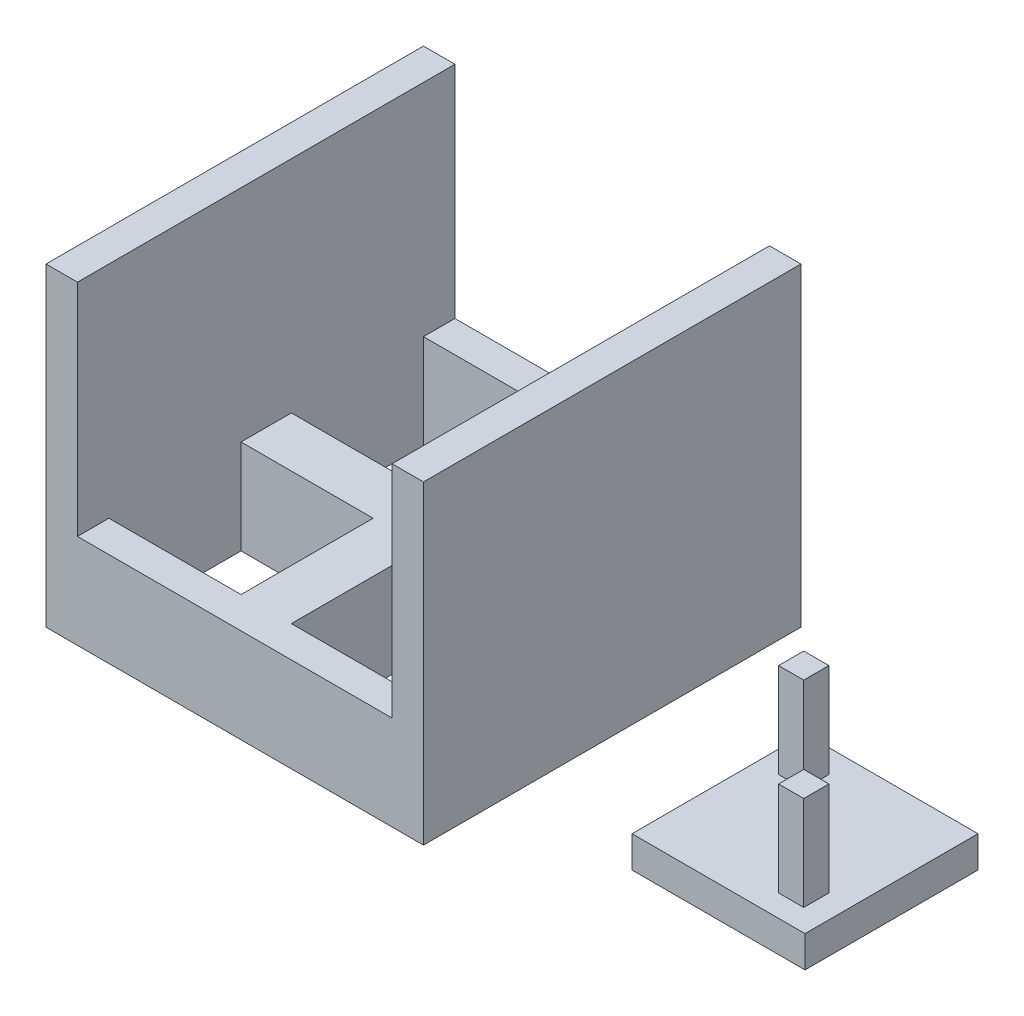
ISO-10303-21;
HEADER;
FILE_DESCRIPTION(('STEP AP214'),'2;1');
FILE_NAME('part.step','',(''),(''),'','','');
FILE_SCHEMA(('AUTOMOTIVE_DESIGN { 1 0 10303 214 1 1 1 1 }'));
ENDSEC;
DATA;
#1=APPLICATION_CONTEXT('core data for automotive mechanical design processes');
#2=APPLICATION_PROTOCOL_DEFINITION('international standard','automotive_design',2000,#1);
#3=PRODUCT_CONTEXT('',#1,'mechanical');
#4=PRODUCT('Part','Part','',(#3));
#5=PRODUCT_RELATED_PRODUCT_CATEGORY('part','',(#4));
#6=PRODUCT_DEFINITION_FORMATION('','',#4);
#7=PRODUCT_DEFINITION_CONTEXT('part definition',#1,'design');
#8=PRODUCT_DEFINITION('design','',#6,#7);
#9=PRODUCT_DEFINITION_SHAPE('','',#8);
#10=(LENGTH_UNIT() NAMED_UNIT(*) SI_UNIT(.MILLI.,.METRE.));
#11=(NAMED_UNIT(*) PLANE_ANGLE_UNIT() SI_UNIT($,.RADIAN.));
#12=(NAMED_UNIT(*) SI_UNIT($,.STERADIAN.) SOLID_ANGLE_UNIT());
#13=UNCERTAINTY_MEASURE_WITH_UNIT(LENGTH_MEASURE(1.E-05),#10,'distance_accuracy_value','');
#14=(GEOMETRIC_REPRESENTATION_CONTEXT(3) GLOBAL_UNCERTAINTY_ASSIGNED_CONTEXT((#13)) GLOBAL_UNIT_ASSIGNED_CONTEXT((#10,
#11,#12)) REPRESENTATION_CONTEXT('',''));
#15=CARTESIAN_POINT('',(0.,0.,0.));
#16=DIRECTION('',(0.,0.,1.));
#17=DIRECTION('',(1.,0.,0.));
#18=AXIS2_PLACEMENT_3D('',#15,#16,#17);
#19=CARTESIAN_POINT('',(0.,5.,0.));
#20=DIRECTION('',(0.,1.,0.));
#21=DIRECTION('',(0.,0.,1.));
#22=AXIS2_PLACEMENT_3D('',#19,#20,#21);
#23=PLANE('',#22);
#24=DIRECTION('',(-1.,0.,0.));
#25=VECTOR('',#24,1.);
#26=CARTESIAN_POINT('',(0.,5.,-2.94544802466099));
#27=LINE('',#26,#25);
#28=CARTESIAN_POINT('',(57.5,5.,-2.94544802466099));
#29=VERTEX_POINT('',#28);
#30=CARTESIAN_POINT('',(53.5,5.,-2.94544802466099));
#31=VERTEX_POINT('',#30);
#32=EDGE_CURVE('E195',#29,#31,#27,.T.);
#33=ORIENTED_EDGE('',*,*,#32,.T.);
#34=DIRECTION('',(0.,0.,-1.));
#35=VECTOR('',#34,1.);
#36=CARTESIAN_POINT('',(53.5,5.,0.));
#37=LINE('',#36,#35);
#38=CARTESIAN_POINT('',(53.5,5.,-6.94544802466099));
#39=VERTEX_POINT('',#38);
#40=EDGE_CURVE('E198',#31,#39,#37,.T.);
#41=ORIENTED_EDGE('',*,*,#40,.T.);
#42=DIRECTION('',(1.,0.,0.));
#43=VECTOR('',#42,1.);
#44=CARTESIAN_POINT('',(0.,5.,-6.94544802466099));
#45=LINE('',#44,#43);
#46=CARTESIAN_POINT('',(57.5,5.,-6.94544802466099));
#47=VERTEX_POINT('',#46);
#48=EDGE_CURVE('E189',#39,#47,#45,.T.);
#49=ORIENTED_EDGE('',*,*,#48,.T.);
#50=DIRECTION('',(0.,0.,1.));
#51=VECTOR('',#50,1.);
#52=CARTESIAN_POINT('',(57.5,5.,0.));
#53=LINE('',#52,#51);
#54=EDGE_CURVE('E192',#47,#29,#53,.T.);
#55=ORIENTED_EDGE('',*,*,#54,.T.);
#56=EDGE_LOOP('',(#33,#41,#49,#55));
#57=FACE_BOUND('',#56,.T.);
#58=DIRECTION('',(0.,0.,-1.));
#59=VECTOR('',#58,1.);
#60=CARTESIAN_POINT('',(77.5,5.,-10.645448024661));
#61=LINE('',#60,#59);
#62=CARTESIAN_POINT('',(77.5,5.,16.854551975339));
#63=VERTEX_POINT('',#62);
#64=CARTESIAN_POINT('',(77.5,5.,-10.645448024661));
#65=VERTEX_POINT('',#64);
#66=EDGE_CURVE('E202',#63,#65,#61,.T.);
#67=ORIENTED_EDGE('',*,*,#66,.T.);
#68=DIRECTION('',(-1.,0.,0.));
#69=VECTOR('',#68,1.);
#70=CARTESIAN_POINT('',(50.,5.,-10.645448024661));
#71=LINE('',#70,#69);
#72=CARTESIAN_POINT('',(50.,5.,-10.645448024661));
#73=VERTEX_POINT('',#72);
#74=EDGE_CURVE('E205',#65,#73,#71,.T.);
#75=ORIENTED_EDGE('',*,*,#74,.T.);
#76=DIRECTION('',(0.,0.,1.));
#77=VECTOR('',#76,1.);
#78=CARTESIAN_POINT('',(50.,5.,-10.645448024661));
#79=LINE('',#78,#77);
#80=CARTESIAN_POINT('',(50.,5.,16.854551975339));
#81=VERTEX_POINT('',#80);
#82=EDGE_CURVE('E208',#73,#81,#79,.T.);
#83=ORIENTED_EDGE('',*,*,#82,.T.);
#84=DIRECTION('',(1.,0.,0.));
#85=VECTOR('',#84,1.);
#86=CARTESIAN_POINT('',(50.,5.,16.854551975339));
#87=LINE('',#86,#85);
#88=EDGE_CURVE('E210',#81,#63,#87,.T.);
#89=ORIENTED_EDGE('',*,*,#88,.T.);
#90=EDGE_LOOP('',(#67,#75,#83,#89));
#91=FACE_BOUND('',#90,.T.);
#92=DIRECTION('',(1.,0.,0.));
#93=VECTOR('',#92,1.);
#94=CARTESIAN_POINT('',(0.,5.,9.35455197533901));
#95=LINE('',#94,#93);
#96=CARTESIAN_POINT('',(69.8,5.,9.35455197533901));
#97=VERTEX_POINT('',#96);
#98=CARTESIAN_POINT('',(73.8,5.,9.35455197533901));
#99=VERTEX_POINT('',#98);
#100=EDGE_CURVE('E167',#97,#99,#95,.T.);
#101=ORIENTED_EDGE('',*,*,#100,.T.);
#102=DIRECTION('',(0.,0.,1.));
#103=VECTOR('',#102,1.);
#104=CARTESIAN_POINT('',(73.8,5.,0.));
#105=LINE('',#104,#103);
#106=CARTESIAN_POINT('',(73.8,5.,13.354551975339));
#107=VERTEX_POINT('',#106);
#108=EDGE_CURVE('E156',#99,#107,#105,.T.);
#109=ORIENTED_EDGE('',*,*,#108,.T.);
#110=DIRECTION('',(-1.,0.,0.));
#111=VECTOR('',#110,1.);
#112=CARTESIAN_POINT('',(0.,5.,13.354551975339));
#113=LINE('',#112,#111);
#114=CARTESIAN_POINT('',(69.8,5.,13.354551975339));
#115=VERTEX_POINT('',#114);
#116=EDGE_CURVE('E157',#107,#115,#113,.T.);
#117=ORIENTED_EDGE('',*,*,#116,.T.);
#118=DIRECTION('',(0.,0.,-1.));
#119=VECTOR('',#118,1.);
#120=CARTESIAN_POINT('',(69.8,5.,0.));
#121=LINE('',#120,#119);
#122=EDGE_CURVE('E160',#115,#97,#121,.T.);
#123=ORIENTED_EDGE('',*,*,#122,.T.);
#124=EDGE_LOOP('',(#101,#109,#117,#123));
#125=FACE_BOUND('',#124,.T.);
#126=ADVANCED_FACE('F43',(#57,#91,#125),#23,.T.);
#127=CARTESIAN_POINT('',(77.5,5.,-10.645448024661));
#128=DIRECTION('',(-1.,0.,0.));
#129=DIRECTION('',(0.,0.,1.));
#130=AXIS2_PLACEMENT_3D('',#127,#128,#129);
#131=PLANE('',#130);
#132=DIRECTION('',(0.,0.,-1.));
#133=VECTOR('',#132,1.);
#134=CARTESIAN_POINT('',(77.5,0.,-10.645448024661));
#135=LINE('',#134,#133);
#136=CARTESIAN_POINT('',(77.5,0.,16.854551975339));
#137=VERTEX_POINT('',#136);
#138=CARTESIAN_POINT('',(77.5,0.,-10.645448024661));
#139=VERTEX_POINT('',#138);
#140=EDGE_CURVE('E201',#137,#139,#135,.T.);
#141=ORIENTED_EDGE('',*,*,#140,.T.);
#142=DIRECTION('',(0.,-1.,0.));
#143=VECTOR('',#142,1.);
#144=CARTESIAN_POINT('',(77.5,5.,-10.645448024661));
#145=LINE('',#144,#143);
#146=EDGE_CURVE('E12',#65,#139,#145,.T.);
#147=ORIENTED_EDGE('',*,*,#146,.F.);
#148=ORIENTED_EDGE('',*,*,#66,.F.);
#149=DIRECTION('',(0.,-1.,0.));
#150=VECTOR('',#149,1.);
#151=CARTESIAN_POINT('',(77.5,5.,16.854551975339));
#152=LINE('',#151,#150);
#153=EDGE_CURVE('E212',#63,#137,#152,.T.);
#154=ORIENTED_EDGE('',*,*,#153,.T.);
#155=EDGE_LOOP('',(#141,#147,#148,#154));
#156=FACE_BOUND('',#155,.T.);
#157=ADVANCED_FACE('F45',(#156),#131,.F.);
#158=CARTESIAN_POINT('',(50.,5.,-10.645448024661));
#159=DIRECTION('',(0.,0.,1.));
#160=DIRECTION('',(1.,0.,0.));
#161=AXIS2_PLACEMENT_3D('',#158,#159,#160);
#162=PLANE('',#161);
#163=DIRECTION('',(-1.,0.,0.));
#164=VECTOR('',#163,1.);
#165=CARTESIAN_POINT('',(50.,0.,-10.645448024661));
#166=LINE('',#165,#164);
#167=CARTESIAN_POINT('',(50.,0.,-10.645448024661));
#168=VERTEX_POINT('',#167);
#169=EDGE_CURVE('E215',#139,#168,#166,.T.);
#170=ORIENTED_EDGE('',*,*,#169,.T.);
#171=DIRECTION('',(0.,-1.,0.));
#172=VECTOR('',#171,1.);
#173=CARTESIAN_POINT('',(50.,5.,-10.645448024661));
#174=LINE('',#173,#172);
#175=EDGE_CURVE('E51',#73,#168,#174,.T.);
#176=ORIENTED_EDGE('',*,*,#175,.F.);
#177=ORIENTED_EDGE('',*,*,#74,.F.);
#178=ORIENTED_EDGE('',*,*,#146,.T.);
#179=EDGE_LOOP('',(#170,#176,#177,#178));
#180=FACE_BOUND('',#179,.T.);
#181=ADVANCED_FACE('F245',(#180),#162,.F.);
#182=CARTESIAN_POINT('',(50.,5.,-10.645448024661));
#183=DIRECTION('',(1.,0.,0.));
#184=DIRECTION('',(0.,0.,-1.));
#185=AXIS2_PLACEMENT_3D('',#182,#183,#184);
#186=PLANE('',#185);
#187=DIRECTION('',(0.,0.,1.));
#188=VECTOR('',#187,1.);
#189=CARTESIAN_POINT('',(50.,0.,-10.645448024661));
#190=LINE('',#189,#188);
#191=CARTESIAN_POINT('',(50.,0.,16.854551975339));
#192=VERTEX_POINT('',#191);
#193=EDGE_CURVE('E217',#168,#192,#190,.T.);
#194=ORIENTED_EDGE('',*,*,#193,.T.);
#195=DIRECTION('',(0.,-1.,0.));
#196=VECTOR('',#195,1.);
#197=CARTESIAN_POINT('',(50.,5.,16.854551975339));
#198=LINE('',#197,#196);
#199=EDGE_CURVE('E222',#81,#192,#198,.T.);
#200=ORIENTED_EDGE('',*,*,#199,.F.);
#201=ORIENTED_EDGE('',*,*,#82,.F.);
#202=ORIENTED_EDGE('',*,*,#175,.T.);
#203=EDGE_LOOP('',(#194,#200,#201,#202));
#204=FACE_BOUND('',#203,.T.);
#205=ADVANCED_FACE('F229',(#204),#186,.F.);
#206=CARTESIAN_POINT('',(50.,5.,16.854551975339));
#207=DIRECTION('',(0.,0.,-1.));
#208=DIRECTION('',(-1.,0.,0.));
#209=AXIS2_PLACEMENT_3D('',#206,#207,#208);
#210=PLANE('',#209);
#211=DIRECTION('',(1.,0.,0.));
#212=VECTOR('',#211,1.);
#213=CARTESIAN_POINT('',(50.,0.,16.854551975339));
#214=LINE('',#213,#212);
#215=EDGE_CURVE('E206',#192,#137,#214,.T.);
#216=ORIENTED_EDGE('',*,*,#215,.T.);
#217=ORIENTED_EDGE('',*,*,#153,.F.);
#218=ORIENTED_EDGE('',*,*,#88,.F.);
#219=ORIENTED_EDGE('',*,*,#199,.T.);
#220=EDGE_LOOP('',(#216,#217,#218,#219));
#221=FACE_BOUND('',#220,.T.);
#222=ADVANCED_FACE('F238',(#221),#210,.F.);
#223=CARTESIAN_POINT('',(0.,0.,0.));
#224=DIRECTION('',(0.,1.,0.));
#225=DIRECTION('',(0.,0.,1.));
#226=AXIS2_PLACEMENT_3D('',#223,#224,#225);
#227=PLANE('',#226);
#228=ORIENTED_EDGE('',*,*,#140,.F.);
#229=ORIENTED_EDGE('',*,*,#215,.F.);
#230=ORIENTED_EDGE('',*,*,#193,.F.);
#231=ORIENTED_EDGE('',*,*,#169,.F.);
#232=EDGE_LOOP('',(#228,#229,#230,#231));
#233=FACE_BOUND('',#232,.T.);
#234=ADVANCED_FACE('F235',(#233),#227,.F.);
#235=CARTESIAN_POINT('',(53.5,20.,-2.94544802466099));
#236=DIRECTION('',(1.,0.,0.));
#237=DIRECTION('',(0.,0.,-1.));
#238=AXIS2_PLACEMENT_3D('',#235,#236,#237);
#239=PLANE('',#238);
#240=ORIENTED_EDGE('',*,*,#40,.F.);
#241=DIRECTION('',(0.,-1.,0.));
#242=VECTOR('',#241,1.);
#243=CARTESIAN_POINT('',(53.5,20.,-2.94544802466099));
#244=LINE('',#243,#242);
#245=CARTESIAN_POINT('',(53.5,20.,-2.94544802466099));
#246=VERTEX_POINT('',#245);
#247=EDGE_CURVE('E186',#246,#31,#244,.T.);
#248=ORIENTED_EDGE('',*,*,#247,.F.);
#249=DIRECTION('',(0.,0.,1.));
#250=VECTOR('',#249,1.);
#251=CARTESIAN_POINT('',(53.5,20.,-2.94544802466099));
#252=LINE('',#251,#250);
#253=CARTESIAN_POINT('',(53.5,20.,-6.94544802466099));
#254=VERTEX_POINT('',#253);
#255=EDGE_CURVE('E170',#254,#246,#252,.T.);
#256=ORIENTED_EDGE('',*,*,#255,.F.);
#257=DIRECTION('',(0.,-1.,0.));
#258=VECTOR('',#257,1.);
#259=CARTESIAN_POINT('',(53.5,20.,-6.94544802466099));
#260=LINE('',#259,#258);
#261=EDGE_CURVE('E179',#254,#39,#260,.T.);
#262=ORIENTED_EDGE('',*,*,#261,.T.);
#263=EDGE_LOOP('',(#240,#248,#256,#262));
#264=FACE_BOUND('',#263,.T.);
#265=ADVANCED_FACE('F259',(#264),#239,.F.);
#266=CARTESIAN_POINT('',(57.5,20.,-2.94544802466099));
#267=DIRECTION('',(0.,0.,-1.));
#268=DIRECTION('',(-1.,0.,0.));
#269=AXIS2_PLACEMENT_3D('',#266,#267,#268);
#270=PLANE('',#269);
#271=ORIENTED_EDGE('',*,*,#32,.F.);
#272=DIRECTION('',(0.,-1.,0.));
#273=VECTOR('',#272,1.);
#274=CARTESIAN_POINT('',(57.5,20.,-2.94544802466099));
#275=LINE('',#274,#273);
#276=CARTESIAN_POINT('',(57.5,20.,-2.94544802466099));
#277=VERTEX_POINT('',#276);
#278=EDGE_CURVE('E183',#277,#29,#275,.T.);
#279=ORIENTED_EDGE('',*,*,#278,.F.);
#280=DIRECTION('',(1.,0.,0.));
#281=VECTOR('',#280,1.);
#282=CARTESIAN_POINT('',(57.5,20.,-2.94544802466099));
#283=LINE('',#282,#281);
#284=EDGE_CURVE('E173',#246,#277,#283,.T.);
#285=ORIENTED_EDGE('',*,*,#284,.F.);
#286=ORIENTED_EDGE('',*,*,#247,.T.);
#287=EDGE_LOOP('',(#271,#279,#285,#286));
#288=FACE_BOUND('',#287,.T.);
#289=ADVANCED_FACE('F279',(#288),#270,.F.);
#290=CARTESIAN_POINT('',(57.5,20.,-2.94544802466099));
#291=DIRECTION('',(-1.,0.,0.));
#292=DIRECTION('',(0.,0.,1.));
#293=AXIS2_PLACEMENT_3D('',#290,#291,#292);
#294=PLANE('',#293);
#295=ORIENTED_EDGE('',*,*,#54,.F.);
#296=DIRECTION('',(0.,-1.,0.));
#297=VECTOR('',#296,1.);
#298=CARTESIAN_POINT('',(57.5,20.,-6.94544802466099));
#299=LINE('',#298,#297);
#300=CARTESIAN_POINT('',(57.5,20.,-6.94544802466099));
#301=VERTEX_POINT('',#300);
#302=EDGE_CURVE('E66',#301,#47,#299,.T.);
#303=ORIENTED_EDGE('',*,*,#302,.F.);
#304=DIRECTION('',(0.,0.,-1.));
#305=VECTOR('',#304,1.);
#306=CARTESIAN_POINT('',(57.5,20.,-2.94544802466099));
#307=LINE('',#306,#305);
#308=EDGE_CURVE('E175',#277,#301,#307,.T.);
#309=ORIENTED_EDGE('',*,*,#308,.F.);
#310=ORIENTED_EDGE('',*,*,#278,.T.);
#311=EDGE_LOOP('',(#295,#303,#309,#310));
#312=FACE_BOUND('',#311,.T.);
#313=ADVANCED_FACE('F286',(#312),#294,.F.);
#314=CARTESIAN_POINT('',(57.5,20.,-6.94544802466099));
#315=DIRECTION('',(0.,0.,1.));
#316=DIRECTION('',(1.,0.,0.));
#317=AXIS2_PLACEMENT_3D('',#314,#315,#316);
#318=PLANE('',#317);
#319=ORIENTED_EDGE('',*,*,#48,.F.);
#320=ORIENTED_EDGE('',*,*,#261,.F.);
#321=DIRECTION('',(-1.,0.,0.));
#322=VECTOR('',#321,1.);
#323=CARTESIAN_POINT('',(57.5,20.,-6.94544802466099));
#324=LINE('',#323,#322);
#325=EDGE_CURVE('E177',#301,#254,#324,.T.);
#326=ORIENTED_EDGE('',*,*,#325,.F.);
#327=ORIENTED_EDGE('',*,*,#302,.T.);
#328=EDGE_LOOP('',(#319,#320,#326,#327));
#329=FACE_BOUND('',#328,.T.);
#330=ADVANCED_FACE('F293',(#329),#318,.F.);
#331=CARTESIAN_POINT('',(0.,20.,0.));
#332=DIRECTION('',(0.,1.,0.));
#333=DIRECTION('',(0.,0.,1.));
#334=AXIS2_PLACEMENT_3D('',#331,#332,#333);
#335=PLANE('',#334);
#336=ORIENTED_EDGE('',*,*,#255,.T.);
#337=ORIENTED_EDGE('',*,*,#284,.T.);
#338=ORIENTED_EDGE('',*,*,#308,.T.);
#339=ORIENTED_EDGE('',*,*,#325,.T.);
#340=EDGE_LOOP('',(#336,#337,#338,#339));
#341=FACE_BOUND('',#340,.T.);
#342=ADVANCED_FACE('F301',(#341),#335,.T.);
#343=CARTESIAN_POINT('',(73.8,20.,9.35455197533901));
#344=DIRECTION('',(-1.,0.,0.));
#345=DIRECTION('',(0.,0.,1.));
#346=AXIS2_PLACEMENT_3D('',#343,#344,#345);
#347=PLANE('',#346);
#348=ORIENTED_EDGE('',*,*,#108,.F.);
#349=DIRECTION('',(0.,-1.,0.));
#350=VECTOR('',#349,1.);
#351=CARTESIAN_POINT('',(73.8,20.,9.35455197533901));
#352=LINE('',#351,#350);
#353=CARTESIAN_POINT('',(73.8,20.,9.35455197533901));
#354=VERTEX_POINT('',#353);
#355=EDGE_CURVE('E138',#354,#99,#352,.T.);
#356=ORIENTED_EDGE('',*,*,#355,.F.);
#357=DIRECTION('',(0.,0.,-1.));
#358=VECTOR('',#357,1.);
#359=CARTESIAN_POINT('',(73.8,20.,9.35455197533901));
#360=LINE('',#359,#358);
#361=CARTESIAN_POINT('',(73.8,20.,13.354551975339));
#362=VERTEX_POINT('',#361);
#363=EDGE_CURVE('E145',#362,#354,#360,.T.);
#364=ORIENTED_EDGE('',*,*,#363,.F.);
#365=DIRECTION('',(0.,-1.,0.));
#366=VECTOR('',#365,1.);
#367=CARTESIAN_POINT('',(73.8,20.,13.354551975339));
#368=LINE('',#367,#366);
#369=EDGE_CURVE('E385',#362,#107,#368,.T.);
#370=ORIENTED_EDGE('',*,*,#369,.T.);
#371=EDGE_LOOP('',(#348,#356,#364,#370));
#372=FACE_BOUND('',#371,.T.);
#373=ADVANCED_FACE('F154',(#372),#347,.F.);
#374=CARTESIAN_POINT('',(69.8,20.,9.35455197533901));
#375=DIRECTION('',(0.,0.,1.));
#376=DIRECTION('',(1.,0.,0.));
#377=AXIS2_PLACEMENT_3D('',#374,#375,#376);
#378=PLANE('',#377);
#379=ORIENTED_EDGE('',*,*,#100,.F.);
#380=DIRECTION('',(0.,-1.,0.));
#381=VECTOR('',#380,1.);
#382=CARTESIAN_POINT('',(69.8,20.,9.35455197533901));
#383=LINE('',#382,#381);
#384=CARTESIAN_POINT('',(69.8,20.,9.35455197533901));
#385=VERTEX_POINT('',#384);
#386=EDGE_CURVE('E141',#385,#97,#383,.T.);
#387=ORIENTED_EDGE('',*,*,#386,.F.);
#388=DIRECTION('',(-1.,0.,0.));
#389=VECTOR('',#388,1.);
#390=CARTESIAN_POINT('',(69.8,20.,9.35455197533901));
#391=LINE('',#390,#389);
#392=EDGE_CURVE('E134',#354,#385,#391,.T.);
#393=ORIENTED_EDGE('',*,*,#392,.F.);
#394=ORIENTED_EDGE('',*,*,#355,.T.);
#395=EDGE_LOOP('',(#379,#387,#393,#394));
#396=FACE_BOUND('',#395,.T.);
#397=ADVANCED_FACE('F136',(#396),#378,.F.);
#398=CARTESIAN_POINT('',(69.8,20.,9.35455197533901));
#399=DIRECTION('',(1.,0.,0.));
#400=DIRECTION('',(0.,0.,-1.));
#401=AXIS2_PLACEMENT_3D('',#398,#399,#400);
#402=PLANE('',#401);
#403=ORIENTED_EDGE('',*,*,#122,.F.);
#404=DIRECTION('',(0.,-1.,0.));
#405=VECTOR('',#404,1.);
#406=CARTESIAN_POINT('',(69.8,20.,13.354551975339));
#407=LINE('',#406,#405);
#408=CARTESIAN_POINT('',(69.8,20.,13.354551975339));
#409=VERTEX_POINT('',#408);
#410=EDGE_CURVE('E58',#409,#115,#407,.T.);
#411=ORIENTED_EDGE('',*,*,#410,.F.);
#412=DIRECTION('',(0.,0.,1.));
#413=VECTOR('',#412,1.);
#414=CARTESIAN_POINT('',(69.8,20.,9.35455197533901));
#415=LINE('',#414,#413);
#416=EDGE_CURVE('E144',#385,#409,#415,.T.);
#417=ORIENTED_EDGE('',*,*,#416,.F.);
#418=ORIENTED_EDGE('',*,*,#386,.T.);
#419=EDGE_LOOP('',(#403,#411,#417,#418));
#420=FACE_BOUND('',#419,.T.);
#421=ADVANCED_FACE('F320',(#420),#402,.F.);
#422=CARTESIAN_POINT('',(69.8,20.,13.354551975339));
#423=DIRECTION('',(0.,0.,-1.));
#424=DIRECTION('',(-1.,0.,0.));
#425=AXIS2_PLACEMENT_3D('',#422,#423,#424);
#426=PLANE('',#425);
#427=ORIENTED_EDGE('',*,*,#116,.F.);
#428=ORIENTED_EDGE('',*,*,#369,.F.);
#429=DIRECTION('',(1.,0.,0.));
#430=VECTOR('',#429,1.);
#431=CARTESIAN_POINT('',(69.8,20.,13.354551975339));
#432=LINE('',#431,#430);
#433=EDGE_CURVE('E149',#409,#362,#432,.T.);
#434=ORIENTED_EDGE('',*,*,#433,.F.);
#435=ORIENTED_EDGE('',*,*,#410,.T.);
#436=EDGE_LOOP('',(#427,#428,#434,#435));
#437=FACE_BOUND('',#436,.T.);
#438=ADVANCED_FACE('F327',(#437),#426,.F.);
#439=CARTESIAN_POINT('',(0.,20.,0.));
#440=DIRECTION('',(0.,1.,0.));
#441=DIRECTION('',(0.,0.,1.));
#442=AXIS2_PLACEMENT_3D('',#439,#440,#441);
#443=PLANE('',#442);
#444=ORIENTED_EDGE('',*,*,#363,.T.);
#445=ORIENTED_EDGE('',*,*,#392,.T.);
#446=ORIENTED_EDGE('',*,*,#416,.T.);
#447=ORIENTED_EDGE('',*,*,#433,.T.);
#448=EDGE_LOOP('',(#444,#445,#446,#447));
#449=FACE_BOUND('',#448,.T.);
#450=ADVANCED_FACE('F148',(#449),#443,.T.);
#451=CLOSED_SHELL('',(#126,#157,#181,#205,#222,#234,#265,#289,#313,#330,#342,#373,#397,#421,
#438,#450));
#452=MANIFOLD_SOLID_BREP('B2',#451);
#453=CARTESIAN_POINT('',(4.,50.,-28.3926039934619));
#454=DIRECTION('',(-1.,0.,0.));
#455=DIRECTION('',(0.,0.,1.));
#456=AXIS2_PLACEMENT_3D('',#453,#454,#455);
#457=PLANE('',#456);
#458=DIRECTION('',(0.,0.,-1.));
#459=VECTOR('',#458,1.);
#460=CARTESIAN_POINT('',(4.,15.,-28.3926039934619));
#461=LINE('',#460,#459);
#462=CARTESIAN_POINT('',(4.00000000000001,15.,-4.));
#463=VERTEX_POINT('',#462);
#464=CARTESIAN_POINT('',(4.,15.,-25.));
#465=VERTEX_POINT('',#464);
#466=EDGE_CURVE('E718',#463,#465,#461,.T.);
#467=ORIENTED_EDGE('',*,*,#466,.F.);
#468=DIRECTION('',(0.,1.,0.));
#469=VECTOR('',#468,1.);
#470=CARTESIAN_POINT('',(4.,50.,-4.));
#471=LINE('',#470,#469);
#472=CARTESIAN_POINT('',(4.,0.,-4.));
#473=VERTEX_POINT('',#472);
#474=EDGE_CURVE('E670',#473,#463,#471,.T.);
#475=ORIENTED_EDGE('',*,*,#474,.F.);
#476=DIRECTION('',(0.,0.,-1.));
#477=VECTOR('',#476,1.);
#478=CARTESIAN_POINT('',(4.,0.,-28.3926039934619));
#479=LINE('',#478,#477);
#480=CARTESIAN_POINT('',(4.,0.,-25.));
#481=VERTEX_POINT('',#480);
#482=EDGE_CURVE('E678',#473,#481,#479,.T.);
#483=ORIENTED_EDGE('',*,*,#482,.T.);
#484=DIRECTION('',(0.,-1.,0.));
#485=VECTOR('',#484,1.);
#486=CARTESIAN_POINT('',(4.,50.,-25.));
#487=LINE('',#486,#485);
#488=EDGE_CURVE('E683',#465,#481,#487,.T.);
#489=ORIENTED_EDGE('',*,*,#488,.F.);
#490=EDGE_LOOP('',(#467,#475,#483,#489));
#491=FACE_BOUND('',#490,.T.);
#492=ADVANCED_FACE('F396',(#491),#457,.F.);
#493=DIRECTION('',(0.,0.,-1.));
#494=VECTOR('',#493,1.);
#495=CARTESIAN_POINT('',(4.,15.,-28.3926039934619));
#496=LINE('',#495,#494);
#497=CARTESIAN_POINT('',(4.,15.,25.));
#498=VERTEX_POINT('',#497);
#499=CARTESIAN_POINT('',(4.,15.,4.));
#500=VERTEX_POINT('',#499);
#501=EDGE_CURVE('E410',#498,#500,#496,.T.);
#502=ORIENTED_EDGE('',*,*,#501,.F.);
#503=DIRECTION('',(0.,1.,0.));
#504=VECTOR('',#503,1.);
#505=CARTESIAN_POINT('',(4.,50.,25.));
#506=LINE('',#505,#504);
#507=CARTESIAN_POINT('',(4.,0.,25.));
#508=VERTEX_POINT('',#507);
#509=EDGE_CURVE('E621',#508,#498,#506,.T.);
#510=ORIENTED_EDGE('',*,*,#509,.F.);
#511=CARTESIAN_POINT('',(4.,0.,4.));
#512=VERTEX_POINT('',#511);
#513=EDGE_CURVE('E679',#508,#512,#479,.T.);
#514=ORIENTED_EDGE('',*,*,#513,.T.);
#515=DIRECTION('',(0.,-1.,0.));
#516=VECTOR('',#515,1.);
#517=CARTESIAN_POINT('',(4.,50.,4.));
#518=LINE('',#517,#516);
#519=EDGE_CURVE('E663',#500,#512,#518,.T.);
#520=ORIENTED_EDGE('',*,*,#519,.F.);
#521=EDGE_LOOP('',(#502,#510,#514,#520));
#522=FACE_BOUND('',#521,.T.);
#523=ADVANCED_FACE('F815',(#522),#457,.F.);
#524=CARTESIAN_POINT('',(-4.,50.,-28.3926039934619));
#525=DIRECTION('',(1.,0.,0.));
#526=DIRECTION('',(0.,0.,-1.));
#527=AXIS2_PLACEMENT_3D('',#524,#525,#526);
#528=PLANE('',#527);
#529=DIRECTION('',(0.,0.,1.));
#530=VECTOR('',#529,1.);
#531=CARTESIAN_POINT('',(-4.,15.,-28.3926039934619));
#532=LINE('',#531,#530);
#533=CARTESIAN_POINT('',(-4.,15.,-25.));
#534=VERTEX_POINT('',#533);
#535=CARTESIAN_POINT('',(-4.,15.,-4.));
#536=VERTEX_POINT('',#535);
#537=EDGE_CURVE('E750',#534,#536,#532,.T.);
#538=ORIENTED_EDGE('',*,*,#537,.F.);
#539=DIRECTION('',(0.,1.,0.));
#540=VECTOR('',#539,1.);
#541=CARTESIAN_POINT('',(-4.,50.,-25.));
#542=LINE('',#541,#540);
#543=CARTESIAN_POINT('',(-4.,0.,-25.));
#544=VERTEX_POINT('',#543);
#545=EDGE_CURVE('E643',#544,#534,#542,.T.);
#546=ORIENTED_EDGE('',*,*,#545,.F.);
#547=DIRECTION('',(0.,0.,1.));
#548=VECTOR('',#547,1.);
#549=CARTESIAN_POINT('',(-4.,0.,-28.3926039934619));
#550=LINE('',#549,#548);
#551=CARTESIAN_POINT('',(-4.,0.,-4.));
#552=VERTEX_POINT('',#551);
#553=EDGE_CURVE('E640',#544,#552,#550,.T.);
#554=ORIENTED_EDGE('',*,*,#553,.T.);
#555=DIRECTION('',(0.,-1.,0.));
#556=VECTOR('',#555,1.);
#557=CARTESIAN_POINT('',(-4.,50.,-4.));
#558=LINE('',#557,#556);
#559=EDGE_CURVE('E404',#536,#552,#558,.T.);
#560=ORIENTED_EDGE('',*,*,#559,.F.);
#561=EDGE_LOOP('',(#538,#546,#554,#560));
#562=FACE_BOUND('',#561,.T.);
#563=ADVANCED_FACE('F641',(#562),#528,.F.);
#564=DIRECTION('',(0.,0.,1.));
#565=VECTOR('',#564,1.);
#566=CARTESIAN_POINT('',(-4.,15.,-28.3926039934619));
#567=LINE('',#566,#565);
#568=CARTESIAN_POINT('',(-4.,15.,4.));
#569=VERTEX_POINT('',#568);
#570=CARTESIAN_POINT('',(-4.,15.,25.));
#571=VERTEX_POINT('',#570);
#572=EDGE_CURVE('E656',#569,#571,#567,.T.);
#573=ORIENTED_EDGE('',*,*,#572,.F.);
#574=DIRECTION('',(0.,1.,0.));
#575=VECTOR('',#574,1.);
#576=CARTESIAN_POINT('',(-4.,50.,4.));
#577=LINE('',#576,#575);
#578=CARTESIAN_POINT('',(-4.,0.,4.));
#579=VERTEX_POINT('',#578);
#580=EDGE_CURVE('E624',#579,#569,#577,.T.);
#581=ORIENTED_EDGE('',*,*,#580,.F.);
#582=CARTESIAN_POINT('',(-4.,0.,25.));
#583=VERTEX_POINT('',#582);
#584=EDGE_CURVE('E647',#579,#583,#550,.T.);
#585=ORIENTED_EDGE('',*,*,#584,.T.);
#586=DIRECTION('',(0.,-1.,0.));
#587=VECTOR('',#586,1.);
#588=CARTESIAN_POINT('',(-4.,50.,25.));
#589=LINE('',#588,#587);
#590=EDGE_CURVE('E619',#571,#583,#589,.T.);
#591=ORIENTED_EDGE('',*,*,#590,.F.);
#592=EDGE_LOOP('',(#573,#581,#585,#591));
#593=FACE_BOUND('',#592,.T.);
#594=ADVANCED_FACE('F769',(#593),#528,.F.);
#595=CARTESIAN_POINT('',(-25.,50.,-25.));
#596=DIRECTION('',(0.,0.,1.));
#597=DIRECTION('',(1.,0.,0.));
#598=AXIS2_PLACEMENT_3D('',#595,#596,#597);
#599=PLANE('',#598);
#600=DIRECTION('',(0.,-1.,0.));
#601=VECTOR('',#600,1.);
#602=CARTESIAN_POINT('',(25.,50.,-25.));
#603=LINE('',#602,#601);
#604=CARTESIAN_POINT('',(25.,15.,-25.));
#605=VERTEX_POINT('',#604);
#606=CARTESIAN_POINT('',(25.,0.,-25.));
#607=VERTEX_POINT('',#606);
#608=EDGE_CURVE('E603',#605,#607,#603,.T.);
#609=ORIENTED_EDGE('',*,*,#608,.F.);
#610=DIRECTION('',(-1.,0.,0.));
#611=VECTOR('',#610,1.);
#612=CARTESIAN_POINT('',(-25.,15.,-25.));
#613=LINE('',#612,#611);
#614=EDGE_CURVE('E714',#605,#465,#613,.T.);
#615=ORIENTED_EDGE('',*,*,#614,.T.);
#616=ORIENTED_EDGE('',*,*,#488,.T.);
#617=DIRECTION('',(-1.,0.,0.));
#618=VECTOR('',#617,1.);
#619=CARTESIAN_POINT('',(-25.,0.,-25.));
#620=LINE('',#619,#618);
#621=EDGE_CURVE('E692',#607,#481,#620,.T.);
#622=ORIENTED_EDGE('',*,*,#621,.F.);
#623=EDGE_LOOP('',(#609,#615,#616,#622));
#624=FACE_BOUND('',#623,.T.);
#625=ADVANCED_FACE('F711',(#624),#599,.T.);
#626=ORIENTED_EDGE('',*,*,#545,.T.);
#627=DIRECTION('',(-1.,0.,0.));
#628=VECTOR('',#627,1.);
#629=CARTESIAN_POINT('',(-25.,15.,-25.));
#630=LINE('',#629,#628);
#631=CARTESIAN_POINT('',(-25.,15.,-25.));
#632=VERTEX_POINT('',#631);
#633=EDGE_CURVE('E752',#534,#632,#630,.T.);
#634=ORIENTED_EDGE('',*,*,#633,.T.);
#635=DIRECTION('',(0.,-1.,0.));
#636=VECTOR('',#635,1.);
#637=CARTESIAN_POINT('',(-25.,50.,-25.));
#638=LINE('',#637,#636);
#639=CARTESIAN_POINT('',(-25.,0.,-25.));
#640=VERTEX_POINT('',#639);
#641=EDGE_CURVE('E703',#632,#640,#638,.T.);
#642=ORIENTED_EDGE('',*,*,#641,.T.);
#643=EDGE_CURVE('E691',#544,#640,#620,.T.);
#644=ORIENTED_EDGE('',*,*,#643,.F.);
#645=EDGE_LOOP('',(#626,#634,#642,#644));
#646=FACE_BOUND('',#645,.T.);
#647=ADVANCED_FACE('F826',(#646),#599,.T.);
#648=CARTESIAN_POINT('',(-25.,50.,25.));
#649=DIRECTION('',(0.,0.,-1.));
#650=DIRECTION('',(-1.,0.,0.));
#651=AXIS2_PLACEMENT_3D('',#648,#649,#650);
#652=PLANE('',#651);
#653=ORIENTED_EDGE('',*,*,#509,.T.);
#654=DIRECTION('',(1.,0.,0.));
#655=VECTOR('',#654,1.);
#656=CARTESIAN_POINT('',(-25.,15.,25.));
#657=LINE('',#656,#655);
#658=CARTESIAN_POINT('',(25.,15.,25.));
#659=VERTEX_POINT('',#658);
#660=EDGE_CURVE('E739',#498,#659,#657,.T.);
#661=ORIENTED_EDGE('',*,*,#660,.T.);
#662=DIRECTION('',(0.,-1.,0.));
#663=VECTOR('',#662,1.);
#664=CARTESIAN_POINT('',(25.,50.,25.));
#665=LINE('',#664,#663);
#666=CARTESIAN_POINT('',(25.,0.,25.));
#667=VERTEX_POINT('',#666);
#668=EDGE_CURVE('E687',#659,#667,#665,.T.);
#669=ORIENTED_EDGE('',*,*,#668,.T.);
#670=DIRECTION('',(1.,0.,0.));
#671=VECTOR('',#670,1.);
#672=CARTESIAN_POINT('',(-25.,0.,25.));
#673=LINE('',#672,#671);
#674=EDGE_CURVE('E697',#508,#667,#673,.T.);
#675=ORIENTED_EDGE('',*,*,#674,.F.);
#676=EDGE_LOOP('',(#653,#661,#669,#675));
#677=FACE_BOUND('',#676,.T.);
#678=ADVANCED_FACE('F738',(#677),#652,.T.);
#679=DIRECTION('',(0.,-1.,0.));
#680=VECTOR('',#679,1.);
#681=CARTESIAN_POINT('',(-25.,50.,25.));
#682=LINE('',#681,#680);
#683=CARTESIAN_POINT('',(-25.,15.,25.));
#684=VERTEX_POINT('',#683);
#685=CARTESIAN_POINT('',(-25.,0.,25.));
#686=VERTEX_POINT('',#685);
#687=EDGE_CURVE('E701',#684,#686,#682,.T.);
#688=ORIENTED_EDGE('',*,*,#687,.F.);
#689=DIRECTION('',(1.,0.,0.));
#690=VECTOR('',#689,1.);
#691=CARTESIAN_POINT('',(-25.,15.,25.));
#692=LINE('',#691,#690);
#693=EDGE_CURVE('E652',#684,#571,#692,.T.);
#694=ORIENTED_EDGE('',*,*,#693,.T.);
#695=ORIENTED_EDGE('',*,*,#590,.T.);
#696=EDGE_CURVE('E571',#686,#583,#673,.T.);
#697=ORIENTED_EDGE('',*,*,#696,.F.);
#698=EDGE_LOOP('',(#688,#694,#695,#697));
#699=FACE_BOUND('',#698,.T.);
#700=ADVANCED_FACE('F766',(#699),#652,.T.);
#701=CARTESIAN_POINT('',(0.,50.,0.));
#702=DIRECTION('',(0.,1.,0.));
#703=DIRECTION('',(0.,0.,1.));
#704=AXIS2_PLACEMENT_3D('',#701,#702,#703);
#705=PLANE('',#704);
#706=DIRECTION('',(-1.,0.,0.));
#707=VECTOR('',#706,1.);
#708=CARTESIAN_POINT('',(-30.,50.,-30.));
#709=LINE('',#708,#707);
#710=CARTESIAN_POINT('',(30.,50.,-30.));
#711=VERTEX_POINT('',#710);
#712=CARTESIAN_POINT('',(25.,50.,-30.));
#713=VERTEX_POINT('',#712);
#714=EDGE_CURVE('E576',#711,#713,#709,.T.);
#715=ORIENTED_EDGE('',*,*,#714,.T.);
#716=DIRECTION('',(0.,0.,-1.));
#717=VECTOR('',#716,1.);
#718=CARTESIAN_POINT('',(25.,50.,-25.));
#719=LINE('',#718,#717);
#720=CARTESIAN_POINT('',(25.,50.,30.));
#721=VERTEX_POINT('',#720);
#722=EDGE_CURVE('E557',#721,#713,#719,.T.);
#723=ORIENTED_EDGE('',*,*,#722,.F.);
#724=DIRECTION('',(1.,0.,0.));
#725=VECTOR('',#724,1.);
#726=CARTESIAN_POINT('',(-30.,50.,30.));
#727=LINE('',#726,#725);
#728=CARTESIAN_POINT('',(30.,50.,30.));
#729=VERTEX_POINT('',#728);
#730=EDGE_CURVE('E590',#721,#729,#727,.T.);
#731=ORIENTED_EDGE('',*,*,#730,.T.);
#732=DIRECTION('',(0.,0.,-1.));
#733=VECTOR('',#732,1.);
#734=CARTESIAN_POINT('',(30.,50.,-30.));
#735=LINE('',#734,#733);
#736=EDGE_CURVE('E585',#729,#711,#735,.T.);
#737=ORIENTED_EDGE('',*,*,#736,.T.);
#738=EDGE_LOOP('',(#715,#723,#731,#737));
#739=FACE_BOUND('',#738,.T.);
#740=ADVANCED_FACE('F583',(#739),#705,.T.);
#741=CARTESIAN_POINT('',(-30.,50.,30.));
#742=VERTEX_POINT('',#741);
#743=CARTESIAN_POINT('',(-25.,50.,30.));
#744=VERTEX_POINT('',#743);
#745=EDGE_CURVE('E595',#742,#744,#727,.T.);
#746=ORIENTED_EDGE('',*,*,#745,.T.);
#747=DIRECTION('',(0.,0.,1.));
#748=VECTOR('',#747,1.);
#749=CARTESIAN_POINT('',(-25.,50.,-25.));
#750=LINE('',#749,#748);
#751=CARTESIAN_POINT('',(-25.,50.,-30.));
#752=VERTEX_POINT('',#751);
#753=EDGE_CURVE('E570',#752,#744,#750,.T.);
#754=ORIENTED_EDGE('',*,*,#753,.F.);
#755=CARTESIAN_POINT('',(-30.,50.,-30.));
#756=VERTEX_POINT('',#755);
#757=EDGE_CURVE('E588',#752,#756,#709,.T.);
#758=ORIENTED_EDGE('',*,*,#757,.T.);
#759=DIRECTION('',(0.,0.,1.));
#760=VECTOR('',#759,1.);
#761=CARTESIAN_POINT('',(-30.,50.,-30.));
#762=LINE('',#761,#760);
#763=EDGE_CURVE('E587',#756,#742,#762,.T.);
#764=ORIENTED_EDGE('',*,*,#763,.T.);
#765=EDGE_LOOP('',(#746,#754,#758,#764));
#766=FACE_BOUND('',#765,.T.);
#767=ADVANCED_FACE('F797',(#766),#705,.T.);
#768=CARTESIAN_POINT('',(-30.,50.,-30.));
#769=DIRECTION('',(0.,0.,1.));
#770=DIRECTION('',(1.,0.,0.));
#771=AXIS2_PLACEMENT_3D('',#768,#769,#770);
#772=PLANE('',#771);
#773=DIRECTION('',(0.,1.,0.));
#774=VECTOR('',#773,1.);
#775=CARTESIAN_POINT('',(25.,50.,-30.));
#776=LINE('',#775,#774);
#777=CARTESIAN_POINT('',(25.,15.,-30.));
#778=VERTEX_POINT('',#777);
#779=EDGE_CURVE('E562',#778,#713,#776,.T.);
#780=ORIENTED_EDGE('',*,*,#779,.T.);
#781=ORIENTED_EDGE('',*,*,#714,.F.);
#782=DIRECTION('',(0.,-1.,0.));
#783=VECTOR('',#782,1.);
#784=CARTESIAN_POINT('',(30.,50.,-30.));
#785=LINE('',#784,#783);
#786=CARTESIAN_POINT('',(30.,0.,-30.));
#787=VERTEX_POINT('',#786);
#788=EDGE_CURVE('E617',#711,#787,#785,.T.);
#789=ORIENTED_EDGE('',*,*,#788,.T.);
#790=DIRECTION('',(-1.,0.,0.));
#791=VECTOR('',#790,1.);
#792=CARTESIAN_POINT('',(-30.,0.,-30.));
#793=LINE('',#792,#791);
#794=CARTESIAN_POINT('',(-30.,0.,-30.));
#795=VERTEX_POINT('',#794);
#796=EDGE_CURVE('E602',#787,#795,#793,.T.);
#797=ORIENTED_EDGE('',*,*,#796,.T.);
#798=DIRECTION('',(0.,-1.,0.));
#799=VECTOR('',#798,1.);
#800=CARTESIAN_POINT('',(-30.,50.,-30.));
#801=LINE('',#800,#799);
#802=EDGE_CURVE('E614',#756,#795,#801,.T.);
#803=ORIENTED_EDGE('',*,*,#802,.F.);
#804=ORIENTED_EDGE('',*,*,#757,.F.);
#805=DIRECTION('',(0.,-1.,0.));
#806=VECTOR('',#805,1.);
#807=CARTESIAN_POINT('',(-25.,50.,-30.));
#808=LINE('',#807,#806);
#809=CARTESIAN_POINT('',(-25.,15.,-30.));
#810=VERTEX_POINT('',#809);
#811=EDGE_CURVE('E581',#752,#810,#808,.T.);
#812=ORIENTED_EDGE('',*,*,#811,.T.);
#813=DIRECTION('',(1.,0.,0.));
#814=VECTOR('',#813,1.);
#815=CARTESIAN_POINT('',(25.,15.,-30.));
#816=LINE('',#815,#814);
#817=EDGE_CURVE('E580',#810,#778,#816,.T.);
#818=ORIENTED_EDGE('',*,*,#817,.T.);
#819=EDGE_LOOP('',(#780,#781,#789,#797,#803,#804,#812,#818));
#820=FACE_BOUND('',#819,.T.);
#821=ADVANCED_FACE('F574',(#820),#772,.F.);
#822=CARTESIAN_POINT('',(-30.,50.,30.));
#823=DIRECTION('',(0.,0.,-1.));
#824=DIRECTION('',(-1.,0.,0.));
#825=AXIS2_PLACEMENT_3D('',#822,#823,#824);
#826=PLANE('',#825);
#827=DIRECTION('',(0.,1.,0.));
#828=VECTOR('',#827,1.);
#829=CARTESIAN_POINT('',(25.,50.,30.));
#830=LINE('',#829,#828);
#831=CARTESIAN_POINT('',(25.,15.,30.));
#832=VERTEX_POINT('',#831);
#833=EDGE_CURVE('E566',#832,#721,#830,.T.);
#834=ORIENTED_EDGE('',*,*,#833,.F.);
#835=DIRECTION('',(1.,0.,0.));
#836=VECTOR('',#835,1.);
#837=CARTESIAN_POINT('',(25.,15.,30.));
#838=LINE('',#837,#836);
#839=CARTESIAN_POINT('',(-25.,15.,30.));
#840=VERTEX_POINT('',#839);
#841=EDGE_CURVE('E786',#840,#832,#838,.T.);
#842=ORIENTED_EDGE('',*,*,#841,.F.);
#843=DIRECTION('',(0.,-1.,0.));
#844=VECTOR('',#843,1.);
#845=CARTESIAN_POINT('',(-25.,50.,30.));
#846=LINE('',#845,#844);
#847=EDGE_CURVE('E779',#744,#840,#846,.T.);
#848=ORIENTED_EDGE('',*,*,#847,.F.);
#849=ORIENTED_EDGE('',*,*,#745,.F.);
#850=DIRECTION('',(0.,-1.,0.));
#851=VECTOR('',#850,1.);
#852=CARTESIAN_POINT('',(-30.,50.,30.));
#853=LINE('',#852,#851);
#854=CARTESIAN_POINT('',(-30.,0.,30.));
#855=VERTEX_POINT('',#854);
#856=EDGE_CURVE('E611',#742,#855,#853,.T.);
#857=ORIENTED_EDGE('',*,*,#856,.T.);
#858=DIRECTION('',(1.,0.,0.));
#859=VECTOR('',#858,1.);
#860=CARTESIAN_POINT('',(-30.,0.,30.));
#861=LINE('',#860,#859);
#862=CARTESIAN_POINT('',(30.,0.,30.));
#863=VERTEX_POINT('',#862);
#864=EDGE_CURVE('E607',#855,#863,#861,.T.);
#865=ORIENTED_EDGE('',*,*,#864,.T.);
#866=DIRECTION('',(0.,-1.,0.));
#867=VECTOR('',#866,1.);
#868=CARTESIAN_POINT('',(30.,50.,30.));
#869=LINE('',#868,#867);
#870=EDGE_CURVE('E598',#729,#863,#869,.T.);
#871=ORIENTED_EDGE('',*,*,#870,.F.);
#872=ORIENTED_EDGE('',*,*,#730,.F.);
#873=EDGE_LOOP('',(#834,#842,#848,#849,#857,#865,#871,#872));
#874=FACE_BOUND('',#873,.T.);
#875=ADVANCED_FACE('F796',(#874),#826,.F.);
#876=CARTESIAN_POINT('',(-28.2079966853118,50.,4.));
#877=DIRECTION('',(0.,0.,-1.));
#878=DIRECTION('',(-1.,0.,0.));
#879=AXIS2_PLACEMENT_3D('',#876,#877,#878);
#880=PLANE('',#879);
#881=DIRECTION('',(1.,0.,0.));
#882=VECTOR('',#881,1.);
#883=CARTESIAN_POINT('',(-28.2079966853118,15.,4.));
#884=LINE('',#883,#882);
#885=CARTESIAN_POINT('',(-25.,15.,4.));
#886=VERTEX_POINT('',#885);
#887=EDGE_CURVE('E755',#886,#569,#884,.T.);
#888=ORIENTED_EDGE('',*,*,#887,.F.);
#889=DIRECTION('',(0.,1.,0.));
#890=VECTOR('',#889,1.);
#891=CARTESIAN_POINT('',(-25.,50.,4.));
#892=LINE('',#891,#890);
#893=CARTESIAN_POINT('',(-25.,0.,4.));
#894=VERTEX_POINT('',#893);
#895=EDGE_CURVE('E665',#894,#886,#892,.T.);
#896=ORIENTED_EDGE('',*,*,#895,.F.);
#897=DIRECTION('',(1.,0.,0.));
#898=VECTOR('',#897,1.);
#899=CARTESIAN_POINT('',(-28.2079966853118,0.,4.));
#900=LINE('',#899,#898);
#901=EDGE_CURVE('E662',#894,#579,#900,.T.);
#902=ORIENTED_EDGE('',*,*,#901,.T.);
#903=ORIENTED_EDGE('',*,*,#580,.T.);
#904=EDGE_LOOP('',(#888,#896,#902,#903));
#905=FACE_BOUND('',#904,.T.);
#906=ADVANCED_FACE('F836',(#905),#880,.F.);
#907=CARTESIAN_POINT('',(-28.2079966853118,50.,-4.));
#908=DIRECTION('',(0.,0.,1.));
#909=DIRECTION('',(1.,0.,0.));
#910=AXIS2_PLACEMENT_3D('',#907,#908,#909);
#911=PLANE('',#910);
#912=DIRECTION('',(-1.,0.,0.));
#913=VECTOR('',#912,1.);
#914=CARTESIAN_POINT('',(-28.2079966853118,15.,-4.));
#915=LINE('',#914,#913);
#916=CARTESIAN_POINT('',(-25.,15.,-4.));
#917=VERTEX_POINT('',#916);
#918=EDGE_CURVE('E636',#536,#917,#915,.T.);
#919=ORIENTED_EDGE('',*,*,#918,.F.);
#920=ORIENTED_EDGE('',*,*,#559,.T.);
#921=DIRECTION('',(-1.,0.,0.));
#922=VECTOR('',#921,1.);
#923=CARTESIAN_POINT('',(-28.2079966853118,0.,-4.));
#924=LINE('',#923,#922);
#925=CARTESIAN_POINT('',(-25.,0.,-4.));
#926=VERTEX_POINT('',#925);
#927=EDGE_CURVE('E634',#552,#926,#924,.T.);
#928=ORIENTED_EDGE('',*,*,#927,.T.);
#929=DIRECTION('',(0.,-1.,0.));
#930=VECTOR('',#929,1.);
#931=CARTESIAN_POINT('',(-25.,50.,-4.));
#932=LINE('',#931,#930);
#933=EDGE_CURVE('E673',#917,#926,#932,.T.);
#934=ORIENTED_EDGE('',*,*,#933,.F.);
#935=EDGE_LOOP('',(#919,#920,#928,#934));
#936=FACE_BOUND('',#935,.T.);
#937=ADVANCED_FACE('F631',(#936),#911,.F.);
#938=DIRECTION('',(-1.,0.,0.));
#939=VECTOR('',#938,1.);
#940=CARTESIAN_POINT('',(-28.2079966853118,15.,-4.));
#941=LINE('',#940,#939);
#942=CARTESIAN_POINT('',(25.,15.,-4.));
#943=VERTEX_POINT('',#942);
#944=EDGE_CURVE('E722',#943,#463,#941,.T.);
#945=ORIENTED_EDGE('',*,*,#944,.F.);
#946=DIRECTION('',(0.,1.,0.));
#947=VECTOR('',#946,1.);
#948=CARTESIAN_POINT('',(25.,50.,-4.));
#949=LINE('',#948,#947);
#950=CARTESIAN_POINT('',(25.,0.,-4.));
#951=VERTEX_POINT('',#950);
#952=EDGE_CURVE('E675',#951,#943,#949,.T.);
#953=ORIENTED_EDGE('',*,*,#952,.F.);
#954=EDGE_CURVE('E418',#951,#473,#924,.T.);
#955=ORIENTED_EDGE('',*,*,#954,.T.);
#956=ORIENTED_EDGE('',*,*,#474,.T.);
#957=EDGE_LOOP('',(#945,#953,#955,#956));
#958=FACE_BOUND('',#957,.T.);
#959=ADVANCED_FACE('F721',(#958),#911,.F.);
#960=DIRECTION('',(1.,0.,0.));
#961=VECTOR('',#960,1.);
#962=CARTESIAN_POINT('',(-28.2079966853118,15.,4.));
#963=LINE('',#962,#961);
#964=CARTESIAN_POINT('',(25.,15.,4.));
#965=VERTEX_POINT('',#964);
#966=EDGE_CURVE('E41',#500,#965,#963,.T.);
#967=ORIENTED_EDGE('',*,*,#966,.F.);
#968=ORIENTED_EDGE('',*,*,#519,.T.);
#969=CARTESIAN_POINT('',(25.,0.,4.));
#970=VERTEX_POINT('',#969);
#971=EDGE_CURVE('E654',#512,#970,#900,.T.);
#972=ORIENTED_EDGE('',*,*,#971,.T.);
#973=DIRECTION('',(0.,-1.,0.));
#974=VECTOR('',#973,1.);
#975=CARTESIAN_POINT('',(25.,50.,4.));
#976=LINE('',#975,#974);
#977=EDGE_CURVE('E668',#965,#970,#976,.T.);
#978=ORIENTED_EDGE('',*,*,#977,.F.);
#979=EDGE_LOOP('',(#967,#968,#972,#978));
#980=FACE_BOUND('',#979,.T.);
#981=ADVANCED_FACE('F729',(#980),#880,.F.);
#982=CARTESIAN_POINT('',(25.,50.,-25.));
#983=DIRECTION('',(-1.,0.,0.));
#984=DIRECTION('',(0.,0.,1.));
#985=AXIS2_PLACEMENT_3D('',#982,#983,#984);
#986=PLANE('',#985);
#987=DIRECTION('',(0.,0.,-1.));
#988=VECTOR('',#987,1.);
#989=CARTESIAN_POINT('',(25.,15.,30.));
#990=LINE('',#989,#988);
#991=EDGE_CURVE('E723',#965,#943,#990,.T.);
#992=ORIENTED_EDGE('',*,*,#991,.F.);
#993=ORIENTED_EDGE('',*,*,#977,.T.);
#994=DIRECTION('',(0.,0.,-1.));
#995=VECTOR('',#994,1.);
#996=CARTESIAN_POINT('',(25.,0.,-25.));
#997=LINE('',#996,#995);
#998=EDGE_CURVE('E688',#667,#970,#997,.T.);
#999=ORIENTED_EDGE('',*,*,#998,.F.);
#1000=ORIENTED_EDGE('',*,*,#668,.F.);
#1001=EDGE_CURVE('E726',#832,#659,#990,.T.);
#1002=ORIENTED_EDGE('',*,*,#1001,.F.);
#1003=ORIENTED_EDGE('',*,*,#833,.T.);
#1004=ORIENTED_EDGE('',*,*,#722,.T.);
#1005=ORIENTED_EDGE('',*,*,#779,.F.);
#1006=EDGE_CURVE('E706',#605,#778,#990,.T.);
#1007=ORIENTED_EDGE('',*,*,#1006,.F.);
#1008=ORIENTED_EDGE('',*,*,#608,.T.);
#1009=EDGE_CURVE('E684',#951,#607,#997,.T.);
#1010=ORIENTED_EDGE('',*,*,#1009,.F.);
#1011=ORIENTED_EDGE('',*,*,#952,.T.);
#1012=EDGE_LOOP('',(#992,#993,#999,#1000,#1002,#1003,#1004,#1005,#1007,#1008,#1010,#1011));
#1013=FACE_BOUND('',#1012,.T.);
#1014=ADVANCED_FACE('F560',(#1013),#986,.T.);
#1015=CARTESIAN_POINT('',(-25.,50.,-25.));
#1016=DIRECTION('',(1.,0.,0.));
#1017=DIRECTION('',(0.,0.,-1.));
#1018=AXIS2_PLACEMENT_3D('',#1015,#1016,#1017);
#1019=PLANE('',#1018);
#1020=DIRECTION('',(0.,0.,-1.));
#1021=VECTOR('',#1020,1.);
#1022=CARTESIAN_POINT('',(-25.,15.,30.));
#1023=LINE('',#1022,#1021);
#1024=EDGE_CURVE('E743',#840,#684,#1023,.T.);
#1025=ORIENTED_EDGE('',*,*,#1024,.T.);
#1026=ORIENTED_EDGE('',*,*,#687,.T.);
#1027=DIRECTION('',(0.,0.,1.));
#1028=VECTOR('',#1027,1.);
#1029=CARTESIAN_POINT('',(-25.,0.,-25.));
#1030=LINE('',#1029,#1028);
#1031=EDGE_CURVE('E695',#894,#686,#1030,.T.);
#1032=ORIENTED_EDGE('',*,*,#1031,.F.);
#1033=ORIENTED_EDGE('',*,*,#895,.T.);
#1034=EDGE_CURVE('E781',#886,#917,#1023,.T.);
#1035=ORIENTED_EDGE('',*,*,#1034,.T.);
#1036=ORIENTED_EDGE('',*,*,#933,.T.);
#1037=EDGE_CURVE('E651',#640,#926,#1030,.T.);
#1038=ORIENTED_EDGE('',*,*,#1037,.F.);
#1039=ORIENTED_EDGE('',*,*,#641,.F.);
#1040=EDGE_CURVE('E782',#632,#810,#1023,.T.);
#1041=ORIENTED_EDGE('',*,*,#1040,.T.);
#1042=ORIENTED_EDGE('',*,*,#811,.F.);
#1043=ORIENTED_EDGE('',*,*,#753,.T.);
#1044=ORIENTED_EDGE('',*,*,#847,.T.);
#1045=EDGE_LOOP('',(#1025,#1026,#1032,#1033,#1035,#1036,#1038,#1039,#1041,#1042,#1043,#1044));
#1046=FACE_BOUND('',#1045,.T.);
#1047=ADVANCED_FACE('F776',(#1046),#1019,.T.);
#1048=CARTESIAN_POINT('',(0.,0.,0.));
#1049=DIRECTION('',(0.,1.,0.));
#1050=DIRECTION('',(0.,0.,1.));
#1051=AXIS2_PLACEMENT_3D('',#1048,#1049,#1050);
#1052=PLANE('',#1051);
#1053=ORIENTED_EDGE('',*,*,#1037,.T.);
#1054=ORIENTED_EDGE('',*,*,#927,.F.);
#1055=ORIENTED_EDGE('',*,*,#553,.F.);
#1056=ORIENTED_EDGE('',*,*,#643,.T.);
#1057=EDGE_LOOP('',(#1053,#1054,#1055,#1056));
#1058=FACE_BOUND('',#1057,.T.);
#1059=ORIENTED_EDGE('',*,*,#482,.F.);
#1060=ORIENTED_EDGE('',*,*,#954,.F.);
#1061=ORIENTED_EDGE('',*,*,#1009,.T.);
#1062=ORIENTED_EDGE('',*,*,#621,.T.);
#1063=EDGE_LOOP('',(#1059,#1060,#1061,#1062));
#1064=FACE_BOUND('',#1063,.T.);
#1065=ORIENTED_EDGE('',*,*,#998,.T.);
#1066=ORIENTED_EDGE('',*,*,#971,.F.);
#1067=ORIENTED_EDGE('',*,*,#513,.F.);
#1068=ORIENTED_EDGE('',*,*,#674,.T.);
#1069=EDGE_LOOP('',(#1065,#1066,#1067,#1068));
#1070=FACE_BOUND('',#1069,.T.);
#1071=ORIENTED_EDGE('',*,*,#584,.F.);
#1072=ORIENTED_EDGE('',*,*,#901,.F.);
#1073=ORIENTED_EDGE('',*,*,#1031,.T.);
#1074=ORIENTED_EDGE('',*,*,#696,.T.);
#1075=EDGE_LOOP('',(#1071,#1072,#1073,#1074));
#1076=FACE_BOUND('',#1075,.T.);
#1077=DIRECTION('',(0.,0.,-1.));
#1078=VECTOR('',#1077,1.);
#1079=CARTESIAN_POINT('',(30.,0.,-30.));
#1080=LINE('',#1079,#1078);
#1081=EDGE_CURVE('E599',#863,#787,#1080,.T.);
#1082=ORIENTED_EDGE('',*,*,#1081,.F.);
#1083=ORIENTED_EDGE('',*,*,#864,.F.);
#1084=DIRECTION('',(0.,0.,1.));
#1085=VECTOR('',#1084,1.);
#1086=CARTESIAN_POINT('',(-30.,0.,-30.));
#1087=LINE('',#1086,#1085);
#1088=EDGE_CURVE('E605',#795,#855,#1087,.T.);
#1089=ORIENTED_EDGE('',*,*,#1088,.F.);
#1090=ORIENTED_EDGE('',*,*,#796,.F.);
#1091=EDGE_LOOP('',(#1082,#1083,#1089,#1090));
#1092=FACE_BOUND('',#1091,.T.);
#1093=ADVANCED_FACE('F649',(#1058,#1064,#1070,#1076,#1092),#1052,.F.);
#1094=CARTESIAN_POINT('',(30.,50.,-30.));
#1095=DIRECTION('',(-1.,0.,0.));
#1096=DIRECTION('',(0.,0.,1.));
#1097=AXIS2_PLACEMENT_3D('',#1094,#1095,#1096);
#1098=PLANE('',#1097);
#1099=ORIENTED_EDGE('',*,*,#1081,.T.);
#1100=ORIENTED_EDGE('',*,*,#788,.F.);
#1101=ORIENTED_EDGE('',*,*,#736,.F.);
#1102=ORIENTED_EDGE('',*,*,#870,.T.);
#1103=EDGE_LOOP('',(#1099,#1100,#1101,#1102));
#1104=FACE_BOUND('',#1103,.T.);
#1105=ADVANCED_FACE('F398',(#1104),#1098,.F.);
#1106=CARTESIAN_POINT('',(-30.,50.,-30.));
#1107=DIRECTION('',(1.,0.,0.));
#1108=DIRECTION('',(0.,0.,-1.));
#1109=AXIS2_PLACEMENT_3D('',#1106,#1107,#1108);
#1110=PLANE('',#1109);
#1111=ORIENTED_EDGE('',*,*,#1088,.T.);
#1112=ORIENTED_EDGE('',*,*,#856,.F.);
#1113=ORIENTED_EDGE('',*,*,#763,.F.);
#1114=ORIENTED_EDGE('',*,*,#802,.T.);
#1115=EDGE_LOOP('',(#1111,#1112,#1113,#1114));
#1116=FACE_BOUND('',#1115,.T.);
#1117=ADVANCED_FACE('F801',(#1116),#1110,.F.);
#1118=CARTESIAN_POINT('',(25.,15.,30.));
#1119=DIRECTION('',(0.,1.,0.));
#1120=DIRECTION('',(-1.,0.,0.));
#1121=AXIS2_PLACEMENT_3D('',#1118,#1119,#1120);
#1122=PLANE('',#1121);
#1123=ORIENTED_EDGE('',*,*,#1024,.F.);
#1124=ORIENTED_EDGE('',*,*,#841,.T.);
#1125=ORIENTED_EDGE('',*,*,#1001,.T.);
#1126=ORIENTED_EDGE('',*,*,#660,.F.);
#1127=ORIENTED_EDGE('',*,*,#501,.T.);
#1128=ORIENTED_EDGE('',*,*,#966,.T.);
#1129=ORIENTED_EDGE('',*,*,#991,.T.);
#1130=ORIENTED_EDGE('',*,*,#944,.T.);
#1131=ORIENTED_EDGE('',*,*,#466,.T.);
#1132=ORIENTED_EDGE('',*,*,#614,.F.);
#1133=ORIENTED_EDGE('',*,*,#1006,.T.);
#1134=ORIENTED_EDGE('',*,*,#817,.F.);
#1135=ORIENTED_EDGE('',*,*,#1040,.F.);
#1136=ORIENTED_EDGE('',*,*,#633,.F.);
#1137=ORIENTED_EDGE('',*,*,#537,.T.);
#1138=ORIENTED_EDGE('',*,*,#918,.T.);
#1139=ORIENTED_EDGE('',*,*,#1034,.F.);
#1140=ORIENTED_EDGE('',*,*,#887,.T.);
#1141=ORIENTED_EDGE('',*,*,#572,.T.);
#1142=ORIENTED_EDGE('',*,*,#693,.F.);
#1143=EDGE_LOOP('',(#1123,#1124,#1125,#1126,#1127,#1128,#1129,#1130,#1131,#1132,#1133,#1134,
#1135,#1136,#1137,#1138,#1139,#1140,#1141,#1142));
#1144=FACE_BOUND('',#1143,.T.);
#1145=ADVANCED_FACE('F758',(#1144),#1122,.T.);
#1146=CLOSED_SHELL('',(#492,#523,#563,#594,#625,#647,#678,#700,#740,#767,#821,#875,#906,#937,
#959,#981,#1014,#1047,#1093,#1105,#1117,#1145));
#1147=MANIFOLD_SOLID_BREP('B6',#1146);
#1148=ADVANCED_BREP_SHAPE_REPRESENTATION('',(#18,#452,#1147),#14);
#1149=SHAPE_DEFINITION_REPRESENTATION(#9,#1148);
ENDSEC;
END-ISO-10303-21;
